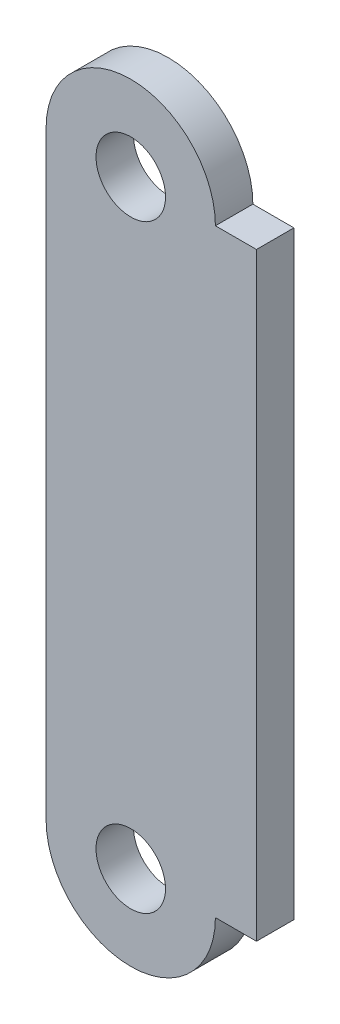
ISO-10303-21;
HEADER;
FILE_DESCRIPTION(('STEP AP214'),'2;1');
FILE_NAME('part.step','',(''),(''),'','','');
FILE_SCHEMA(('AUTOMOTIVE_DESIGN { 1 0 10303 214 1 1 1 1 }'));
ENDSEC;
DATA;
#1=APPLICATION_CONTEXT('core data for automotive mechanical design processes');
#2=APPLICATION_PROTOCOL_DEFINITION('international standard','automotive_design',2000,#1);
#3=PRODUCT_CONTEXT('',#1,'mechanical');
#4=PRODUCT('Part','Part','',(#3));
#5=PRODUCT_RELATED_PRODUCT_CATEGORY('part','',(#4));
#6=PRODUCT_DEFINITION_FORMATION('','',#4);
#7=PRODUCT_DEFINITION_CONTEXT('part definition',#1,'design');
#8=PRODUCT_DEFINITION('design','',#6,#7);
#9=PRODUCT_DEFINITION_SHAPE('','',#8);
#10=(LENGTH_UNIT() NAMED_UNIT(*) SI_UNIT(.MILLI.,.METRE.));
#11=(NAMED_UNIT(*) PLANE_ANGLE_UNIT() SI_UNIT($,.RADIAN.));
#12=(NAMED_UNIT(*) SI_UNIT($,.STERADIAN.) SOLID_ANGLE_UNIT());
#13=UNCERTAINTY_MEASURE_WITH_UNIT(LENGTH_MEASURE(1.E-05),#10,'distance_accuracy_value','');
#14=(GEOMETRIC_REPRESENTATION_CONTEXT(3) GLOBAL_UNCERTAINTY_ASSIGNED_CONTEXT((#13)) GLOBAL_UNIT_ASSIGNED_CONTEXT((#10,
#11,#12)) REPRESENTATION_CONTEXT('',''));
#15=CARTESIAN_POINT('',(0.,0.,0.));
#16=DIRECTION('',(0.,0.,1.));
#17=DIRECTION('',(1.,0.,0.));
#18=AXIS2_PLACEMENT_3D('',#15,#16,#17);
#19=CARTESIAN_POINT('',(0.,12.7,1.5875));
#20=DIRECTION('',(0.,0.,-1.));
#21=DIRECTION('',(-1.,0.,0.));
#22=AXIS2_PLACEMENT_3D('',#19,#20,#21);
#23=CYLINDRICAL_SURFACE('',#22,3.58902);
#24=CARTESIAN_POINT('',(0.,12.7,0.));
#25=DIRECTION('',(0.,0.,1.));
#26=DIRECTION('',(1.,0.,0.));
#27=AXIS2_PLACEMENT_3D('',#24,#25,#26);
#28=CIRCLE('',#27,3.58902);
#29=CARTESIAN_POINT('',(3.58902,12.7,0.));
#30=VERTEX_POINT('',#29);
#31=CARTESIAN_POINT('',(-3.58902,12.7,0.));
#32=VERTEX_POINT('',#31);
#33=EDGE_CURVE('E140',#30,#32,#28,.T.);
#34=ORIENTED_EDGE('',*,*,#33,.T.);
#35=DIRECTION('',(0.,0.,-1.));
#36=VECTOR('',#35,1.);
#37=CARTESIAN_POINT('',(-3.58902,12.7,1.5875));
#38=LINE('',#37,#36);
#39=CARTESIAN_POINT('',(-3.58902,12.7,1.5875));
#40=VERTEX_POINT('',#39);
#41=EDGE_CURVE('E11',#40,#32,#38,.T.);
#42=ORIENTED_EDGE('',*,*,#41,.F.);
#43=CARTESIAN_POINT('',(0.,12.7,1.5875));
#44=DIRECTION('',(0.,0.,1.));
#45=DIRECTION('',(1.,0.,0.));
#46=AXIS2_PLACEMENT_3D('',#43,#44,#45);
#47=CIRCLE('',#46,3.58902);
#48=CARTESIAN_POINT('',(3.58902,12.7,1.5875));
#49=VERTEX_POINT('',#48);
#50=EDGE_CURVE('E50',#49,#40,#47,.T.);
#51=ORIENTED_EDGE('',*,*,#50,.F.);
#52=DIRECTION('',(0.,0.,-1.));
#53=VECTOR('',#52,1.);
#54=CARTESIAN_POINT('',(3.58902,12.7,1.5875));
#55=LINE('',#54,#53);
#56=EDGE_CURVE('E139',#49,#30,#55,.T.);
#57=ORIENTED_EDGE('',*,*,#56,.T.);
#58=EDGE_LOOP('',(#34,#42,#51,#57));
#59=FACE_BOUND('',#58,.T.);
#60=ADVANCED_FACE('F33',(#59),#23,.T.);
#61=CARTESIAN_POINT('',(-3.58902,12.7,1.5875));
#62=DIRECTION('',(1.,0.,0.));
#63=DIRECTION('',(0.,1.,0.));
#64=AXIS2_PLACEMENT_3D('',#61,#62,#63);
#65=PLANE('',#64);
#66=DIRECTION('',(0.,-1.,0.));
#67=VECTOR('',#66,1.);
#68=CARTESIAN_POINT('',(-3.58902,12.7,0.));
#69=LINE('',#68,#67);
#70=CARTESIAN_POINT('',(-3.58902,-12.7,0.));
#71=VERTEX_POINT('',#70);
#72=EDGE_CURVE('E64',#32,#71,#69,.T.);
#73=ORIENTED_EDGE('',*,*,#72,.T.);
#74=DIRECTION('',(0.,0.,-1.));
#75=VECTOR('',#74,1.);
#76=CARTESIAN_POINT('',(-3.58902,-12.7,1.5875));
#77=LINE('',#76,#75);
#78=CARTESIAN_POINT('',(-3.58902,-12.7,1.5875));
#79=VERTEX_POINT('',#78);
#80=EDGE_CURVE('E42',#79,#71,#77,.T.);
#81=ORIENTED_EDGE('',*,*,#80,.F.);
#82=DIRECTION('',(0.,-1.,0.));
#83=VECTOR('',#82,1.);
#84=CARTESIAN_POINT('',(-3.58902,12.7,1.5875));
#85=LINE('',#84,#83);
#86=EDGE_CURVE('E76',#40,#79,#85,.T.);
#87=ORIENTED_EDGE('',*,*,#86,.F.);
#88=ORIENTED_EDGE('',*,*,#41,.T.);
#89=EDGE_LOOP('',(#73,#81,#87,#88));
#90=FACE_BOUND('',#89,.T.);
#91=ADVANCED_FACE('F154',(#90),#65,.F.);
#92=CARTESIAN_POINT('',(0.,-12.7,1.5875));
#93=DIRECTION('',(0.,0.,-1.));
#94=DIRECTION('',(-1.,0.,0.));
#95=AXIS2_PLACEMENT_3D('',#92,#93,#94);
#96=CYLINDRICAL_SURFACE('',#95,3.58902);
#97=CARTESIAN_POINT('',(0.,-12.7,0.));
#98=DIRECTION('',(0.,0.,1.));
#99=DIRECTION('',(1.,0.,0.));
#100=AXIS2_PLACEMENT_3D('',#97,#98,#99);
#101=CIRCLE('',#100,3.58902);
#102=CARTESIAN_POINT('',(3.58902,-12.7,0.));
#103=VERTEX_POINT('',#102);
#104=EDGE_CURVE('E71',#71,#103,#101,.T.);
#105=ORIENTED_EDGE('',*,*,#104,.T.);
#106=DIRECTION('',(0.,0.,-1.));
#107=VECTOR('',#106,1.);
#108=CARTESIAN_POINT('',(3.58902,-12.7,1.5875));
#109=LINE('',#108,#107);
#110=CARTESIAN_POINT('',(3.58902,-12.7,1.5875));
#111=VERTEX_POINT('',#110);
#112=EDGE_CURVE('E146',#111,#103,#109,.T.);
#113=ORIENTED_EDGE('',*,*,#112,.F.);
#114=CARTESIAN_POINT('',(0.,-12.7,1.5875));
#115=DIRECTION('',(0.,0.,1.));
#116=DIRECTION('',(1.,0.,0.));
#117=AXIS2_PLACEMENT_3D('',#114,#115,#116);
#118=CIRCLE('',#117,3.58902);
#119=EDGE_CURVE('E117',#79,#111,#118,.T.);
#120=ORIENTED_EDGE('',*,*,#119,.F.);
#121=ORIENTED_EDGE('',*,*,#80,.T.);
#122=EDGE_LOOP('',(#105,#113,#120,#121));
#123=FACE_BOUND('',#122,.T.);
#124=ADVANCED_FACE('F148',(#123),#96,.T.);
#125=CARTESIAN_POINT('',(0.,12.7,1.5875));
#126=DIRECTION('',(0.,0.,1.));
#127=DIRECTION('',(1.,0.,0.));
#128=AXIS2_PLACEMENT_3D('',#125,#126,#127);
#129=PLANE('',#128);
#130=CARTESIAN_POINT('',(0.,12.7,1.5875));
#131=DIRECTION('',(0.,0.,1.));
#132=DIRECTION('',(1.,0.,0.));
#133=AXIS2_PLACEMENT_3D('',#130,#131,#132);
#134=CIRCLE('',#133,1.47319999999999);
#135=CARTESIAN_POINT('',(1.47319999999998,12.7,1.5875));
#136=VERTEX_POINT('',#135);
#137=EDGE_CURVE('E127',#136,#136,#134,.T.);
#138=ORIENTED_EDGE('',*,*,#137,.F.);
#139=EDGE_LOOP('',(#138));
#140=FACE_BOUND('',#139,.T.);
#141=CARTESIAN_POINT('',(0.,-12.7,1.5875));
#142=DIRECTION('',(0.,0.,1.));
#143=DIRECTION('',(1.,0.,0.));
#144=AXIS2_PLACEMENT_3D('',#141,#142,#143);
#145=CIRCLE('',#144,1.47319999999999);
#146=CARTESIAN_POINT('',(1.47319999999999,-12.7,1.5875));
#147=VERTEX_POINT('',#146);
#148=EDGE_CURVE('E133',#147,#147,#145,.T.);
#149=ORIENTED_EDGE('',*,*,#148,.F.);
#150=EDGE_LOOP('',(#149));
#151=FACE_BOUND('',#150,.T.);
#152=ORIENTED_EDGE('',*,*,#50,.T.);
#153=ORIENTED_EDGE('',*,*,#86,.T.);
#154=ORIENTED_EDGE('',*,*,#119,.T.);
#155=DIRECTION('',(1.,0.,0.));
#156=VECTOR('',#155,1.);
#157=CARTESIAN_POINT('',(3.58902,-12.7,1.5875));
#158=LINE('',#157,#156);
#159=CARTESIAN_POINT('',(5.32892,-12.7,1.5875));
#160=VERTEX_POINT('',#159);
#161=EDGE_CURVE('E100',#111,#160,#158,.T.);
#162=ORIENTED_EDGE('',*,*,#161,.T.);
#163=DIRECTION('',(0.,1.,0.));
#164=VECTOR('',#163,1.);
#165=CARTESIAN_POINT('',(5.32892,12.7,1.5875));
#166=LINE('',#165,#164);
#167=CARTESIAN_POINT('',(5.32892,12.7,1.5875));
#168=VERTEX_POINT('',#167);
#169=EDGE_CURVE('E108',#160,#168,#166,.T.);
#170=ORIENTED_EDGE('',*,*,#169,.T.);
#171=DIRECTION('',(-1.,0.,0.));
#172=VECTOR('',#171,1.);
#173=CARTESIAN_POINT('',(3.58902,12.7,1.5875));
#174=LINE('',#173,#172);
#175=EDGE_CURVE('E105',#168,#49,#174,.T.);
#176=ORIENTED_EDGE('',*,*,#175,.T.);
#177=EDGE_LOOP('',(#152,#153,#154,#162,#170,#176));
#178=FACE_BOUND('',#177,.T.);
#179=ADVANCED_FACE('F115',(#140,#151,#178),#129,.T.);
#180=CARTESIAN_POINT('',(0.,12.7,0.));
#181=DIRECTION('',(0.,0.,1.));
#182=DIRECTION('',(1.,0.,0.));
#183=AXIS2_PLACEMENT_3D('',#180,#181,#182);
#184=PLANE('',#183);
#185=CARTESIAN_POINT('',(0.,12.7,0.));
#186=DIRECTION('',(0.,0.,1.));
#187=DIRECTION('',(1.,0.,0.));
#188=AXIS2_PLACEMENT_3D('',#185,#186,#187);
#189=CIRCLE('',#188,1.47319999999999);
#190=CARTESIAN_POINT('',(1.47319999999998,12.7,0.));
#191=VERTEX_POINT('',#190);
#192=EDGE_CURVE('E130',#191,#191,#189,.T.);
#193=ORIENTED_EDGE('',*,*,#192,.T.);
#194=EDGE_LOOP('',(#193));
#195=FACE_BOUND('',#194,.T.);
#196=CARTESIAN_POINT('',(0.,-12.7,0.));
#197=DIRECTION('',(0.,0.,1.));
#198=DIRECTION('',(1.,0.,0.));
#199=AXIS2_PLACEMENT_3D('',#196,#197,#198);
#200=CIRCLE('',#199,1.47319999999999);
#201=CARTESIAN_POINT('',(1.47319999999999,-12.7,0.));
#202=VERTEX_POINT('',#201);
#203=EDGE_CURVE('E36',#202,#202,#200,.T.);
#204=ORIENTED_EDGE('',*,*,#203,.T.);
#205=EDGE_LOOP('',(#204));
#206=FACE_BOUND('',#205,.T.);
#207=ORIENTED_EDGE('',*,*,#33,.F.);
#208=DIRECTION('',(1.,0.,0.));
#209=VECTOR('',#208,1.);
#210=CARTESIAN_POINT('',(3.58902,12.7,0.));
#211=LINE('',#210,#209);
#212=CARTESIAN_POINT('',(5.32892,12.7,0.));
#213=VERTEX_POINT('',#212);
#214=EDGE_CURVE('E120',#30,#213,#211,.T.);
#215=ORIENTED_EDGE('',*,*,#214,.T.);
#216=DIRECTION('',(0.,-1.,0.));
#217=VECTOR('',#216,1.);
#218=CARTESIAN_POINT('',(5.32892,12.7,0.));
#219=LINE('',#218,#217);
#220=CARTESIAN_POINT('',(5.32892,-12.7,0.));
#221=VERTEX_POINT('',#220);
#222=EDGE_CURVE('E124',#213,#221,#219,.T.);
#223=ORIENTED_EDGE('',*,*,#222,.T.);
#224=DIRECTION('',(-1.,0.,0.));
#225=VECTOR('',#224,1.);
#226=CARTESIAN_POINT('',(3.58902,-12.7,0.));
#227=LINE('',#226,#225);
#228=EDGE_CURVE('E101',#221,#103,#227,.T.);
#229=ORIENTED_EDGE('',*,*,#228,.T.);
#230=ORIENTED_EDGE('',*,*,#104,.F.);
#231=ORIENTED_EDGE('',*,*,#72,.F.);
#232=EDGE_LOOP('',(#207,#215,#223,#229,#230,#231));
#233=FACE_BOUND('',#232,.T.);
#234=ADVANCED_FACE('F150',(#195,#206,#233),#184,.F.);
#235=CARTESIAN_POINT('',(0.,-12.7,1.5875));
#236=DIRECTION('',(0.,0.,1.));
#237=DIRECTION('',(1.,0.,0.));
#238=AXIS2_PLACEMENT_3D('',#235,#236,#237);
#239=CYLINDRICAL_SURFACE('',#238,1.47319999999999);
#240=ORIENTED_EDGE('',*,*,#148,.T.);
#241=EDGE_LOOP('',(#240));
#242=FACE_BOUND('',#241,.T.);
#243=ORIENTED_EDGE('',*,*,#203,.F.);
#244=EDGE_LOOP('',(#243));
#245=FACE_BOUND('',#244,.T.);
#246=ADVANCED_FACE('F164',(#242,#245),#239,.F.);
#247=CARTESIAN_POINT('',(0.,12.7,1.5875));
#248=DIRECTION('',(0.,0.,1.));
#249=DIRECTION('',(1.,0.,0.));
#250=AXIS2_PLACEMENT_3D('',#247,#248,#249);
#251=CYLINDRICAL_SURFACE('',#250,1.47319999999999);
#252=ORIENTED_EDGE('',*,*,#137,.T.);
#253=EDGE_LOOP('',(#252));
#254=FACE_BOUND('',#253,.T.);
#255=ORIENTED_EDGE('',*,*,#192,.F.);
#256=EDGE_LOOP('',(#255));
#257=FACE_BOUND('',#256,.T.);
#258=ADVANCED_FACE('F171',(#254,#257),#251,.F.);
#259=CARTESIAN_POINT('',(3.58902,12.7,-25.4595218338837));
#260=DIRECTION('',(0.,1.,0.));
#261=DIRECTION('',(0.,0.,1.));
#262=AXIS2_PLACEMENT_3D('',#259,#260,#261);
#263=PLANE('',#262);
#264=ORIENTED_EDGE('',*,*,#214,.F.);
#265=ORIENTED_EDGE('',*,*,#56,.F.);
#266=ORIENTED_EDGE('',*,*,#175,.F.);
#267=DIRECTION('',(0.,0.,1.));
#268=VECTOR('',#267,1.);
#269=CARTESIAN_POINT('',(5.32892,12.7,-25.4595218338837));
#270=LINE('',#269,#268);
#271=EDGE_CURVE('E104',#213,#168,#270,.T.);
#272=ORIENTED_EDGE('',*,*,#271,.F.);
#273=EDGE_LOOP('',(#264,#265,#266,#272));
#274=FACE_BOUND('',#273,.T.);
#275=ADVANCED_FACE('F153',(#274),#263,.T.);
#276=CARTESIAN_POINT('',(5.32892,12.7,-25.4595218338837));
#277=DIRECTION('',(1.,0.,0.));
#278=DIRECTION('',(0.,1.,0.));
#279=AXIS2_PLACEMENT_3D('',#276,#277,#278);
#280=PLANE('',#279);
#281=ORIENTED_EDGE('',*,*,#222,.F.);
#282=ORIENTED_EDGE('',*,*,#271,.T.);
#283=ORIENTED_EDGE('',*,*,#169,.F.);
#284=DIRECTION('',(0.,0.,1.));
#285=VECTOR('',#284,1.);
#286=CARTESIAN_POINT('',(5.32892,-12.7,-25.4595218338837));
#287=LINE('',#286,#285);
#288=EDGE_CURVE('E95',#221,#160,#287,.T.);
#289=ORIENTED_EDGE('',*,*,#288,.F.);
#290=EDGE_LOOP('',(#281,#282,#283,#289));
#291=FACE_BOUND('',#290,.T.);
#292=ADVANCED_FACE('F109',(#291),#280,.T.);
#293=CARTESIAN_POINT('',(3.58902,-12.7,-25.4595218338837));
#294=DIRECTION('',(0.,-1.,0.));
#295=DIRECTION('',(0.,0.,-1.));
#296=AXIS2_PLACEMENT_3D('',#293,#294,#295);
#297=PLANE('',#296);
#298=ORIENTED_EDGE('',*,*,#228,.F.);
#299=ORIENTED_EDGE('',*,*,#288,.T.);
#300=ORIENTED_EDGE('',*,*,#161,.F.);
#301=ORIENTED_EDGE('',*,*,#112,.T.);
#302=EDGE_LOOP('',(#298,#299,#300,#301));
#303=FACE_BOUND('',#302,.T.);
#304=ADVANCED_FACE('F97',(#303),#297,.T.);
#305=CLOSED_SHELL('',(#60,#91,#124,#179,#234,#246,#258,#275,#292,#304));
#306=MANIFOLD_SOLID_BREP('B2',#305);
#307=ADVANCED_BREP_SHAPE_REPRESENTATION('',(#18,#306),#14);
#308=SHAPE_DEFINITION_REPRESENTATION(#9,#307);
ENDSEC;
END-ISO-10303-21;
